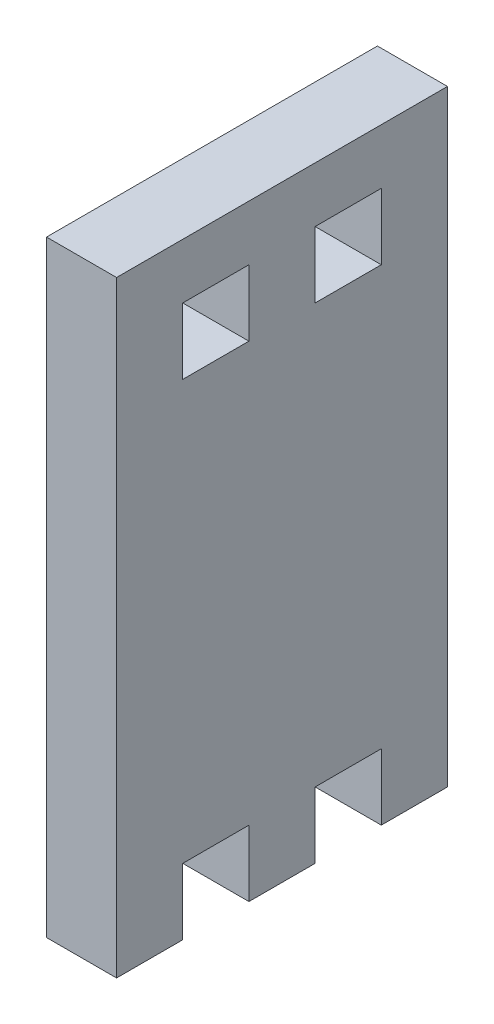
ISO-10303-21;
HEADER;
FILE_DESCRIPTION(('STEP AP214'),'2;1');
FILE_NAME('part.step','',(''),(''),'','','');
FILE_SCHEMA(('AUTOMOTIVE_DESIGN { 1 0 10303 214 1 1 1 1 }'));
ENDSEC;
DATA;
#1=APPLICATION_CONTEXT('core data for automotive mechanical design processes');
#2=APPLICATION_PROTOCOL_DEFINITION('international standard','automotive_design',2000,#1);
#3=PRODUCT_CONTEXT('',#1,'mechanical');
#4=PRODUCT('Part','Part','',(#3));
#5=PRODUCT_RELATED_PRODUCT_CATEGORY('part','',(#4));
#6=PRODUCT_DEFINITION_FORMATION('','',#4);
#7=PRODUCT_DEFINITION_CONTEXT('part definition',#1,'design');
#8=PRODUCT_DEFINITION('design','',#6,#7);
#9=PRODUCT_DEFINITION_SHAPE('','',#8);
#10=(LENGTH_UNIT() NAMED_UNIT(*) SI_UNIT(.MILLI.,.METRE.));
#11=(NAMED_UNIT(*) PLANE_ANGLE_UNIT() SI_UNIT($,.RADIAN.));
#12=(NAMED_UNIT(*) SI_UNIT($,.STERADIAN.) SOLID_ANGLE_UNIT());
#13=UNCERTAINTY_MEASURE_WITH_UNIT(LENGTH_MEASURE(1.E-05),#10,'distance_accuracy_value','');
#14=(GEOMETRIC_REPRESENTATION_CONTEXT(3) GLOBAL_UNCERTAINTY_ASSIGNED_CONTEXT((#13)) GLOBAL_UNIT_ASSIGNED_CONTEXT((#10,
#11,#12)) REPRESENTATION_CONTEXT('',''));
#15=CARTESIAN_POINT('',(0.,0.,0.));
#16=DIRECTION('',(0.,0.,1.));
#17=DIRECTION('',(1.,0.,0.));
#18=AXIS2_PLACEMENT_3D('',#15,#16,#17);
#19=CARTESIAN_POINT('',(6.35,0.,2.99999999999999));
#20=DIRECTION('',(0.,0.,-1.));
#21=DIRECTION('',(0.,1.,0.));
#22=AXIS2_PLACEMENT_3D('',#19,#20,#21);
#23=PLANE('',#22);
#24=DIRECTION('',(0.,-1.,0.));
#25=VECTOR('',#24,1.);
#26=CARTESIAN_POINT('',(0.,0.,2.99999999999999));
#27=LINE('',#26,#25);
#28=CARTESIAN_POINT('',(0.,-21.5,2.99999999999999));
#29=VERTEX_POINT('',#28);
#30=CARTESIAN_POINT('',(0.,-27.5,2.99999999999999));
#31=VERTEX_POINT('',#30);
#32=EDGE_CURVE('E233',#29,#31,#27,.T.);
#33=ORIENTED_EDGE('',*,*,#32,.T.);
#34=DIRECTION('',(-1.,0.,0.));
#35=VECTOR('',#34,1.);
#36=CARTESIAN_POINT('',(6.35,-27.5,2.99999999999999));
#37=LINE('',#36,#35);
#38=CARTESIAN_POINT('',(6.35,-27.5,2.99999999999999));
#39=VERTEX_POINT('',#38);
#40=EDGE_CURVE('E11',#39,#31,#37,.T.);
#41=ORIENTED_EDGE('',*,*,#40,.F.);
#42=DIRECTION('',(0.,-1.,0.));
#43=VECTOR('',#42,1.);
#44=CARTESIAN_POINT('',(6.35,0.,2.99999999999999));
#45=LINE('',#44,#43);
#46=CARTESIAN_POINT('',(6.35,-21.5,2.99999999999999));
#47=VERTEX_POINT('',#46);
#48=EDGE_CURVE('E420',#47,#39,#45,.T.);
#49=ORIENTED_EDGE('',*,*,#48,.F.);
#50=DIRECTION('',(-1.,0.,0.));
#51=VECTOR('',#50,1.);
#52=CARTESIAN_POINT('',(6.35,-21.5,2.99999999999999));
#53=LINE('',#52,#51);
#54=EDGE_CURVE('E52',#47,#29,#53,.T.);
#55=ORIENTED_EDGE('',*,*,#54,.T.);
#56=EDGE_LOOP('',(#33,#41,#49,#55));
#57=FACE_BOUND('',#56,.T.);
#58=ADVANCED_FACE('F33',(#57),#23,.F.);
#59=CARTESIAN_POINT('',(6.35,-27.5,0.));
#60=DIRECTION('',(0.,1.,0.));
#61=DIRECTION('',(0.,0.,1.));
#62=AXIS2_PLACEMENT_3D('',#59,#60,#61);
#63=PLANE('',#62);
#64=DIRECTION('',(0.,0.,-1.));
#65=VECTOR('',#64,1.);
#66=CARTESIAN_POINT('',(0.,-27.5,0.));
#67=LINE('',#66,#65);
#68=CARTESIAN_POINT('',(0.,-27.5,-2.99999999999999));
#69=VERTEX_POINT('',#68);
#70=EDGE_CURVE('E235',#31,#69,#67,.T.);
#71=ORIENTED_EDGE('',*,*,#70,.T.);
#72=DIRECTION('',(-1.,0.,0.));
#73=VECTOR('',#72,1.);
#74=CARTESIAN_POINT('',(6.35,-27.5,-2.99999999999999));
#75=LINE('',#74,#73);
#76=CARTESIAN_POINT('',(6.35,-27.5,-2.99999999999999));
#77=VERTEX_POINT('',#76);
#78=EDGE_CURVE('E43',#77,#69,#75,.T.);
#79=ORIENTED_EDGE('',*,*,#78,.F.);
#80=DIRECTION('',(0.,0.,-1.));
#81=VECTOR('',#80,1.);
#82=CARTESIAN_POINT('',(6.35,-27.5,0.));
#83=LINE('',#82,#81);
#84=EDGE_CURVE('E421',#39,#77,#83,.T.);
#85=ORIENTED_EDGE('',*,*,#84,.F.);
#86=ORIENTED_EDGE('',*,*,#40,.T.);
#87=EDGE_LOOP('',(#71,#79,#85,#86));
#88=FACE_BOUND('',#87,.T.);
#89=ADVANCED_FACE('F323',(#88),#63,.F.);
#90=CARTESIAN_POINT('',(6.35,0.,-2.99999999999999));
#91=DIRECTION('',(0.,0.,-1.));
#92=DIRECTION('',(0.,1.,0.));
#93=AXIS2_PLACEMENT_3D('',#90,#91,#92);
#94=PLANE('',#93);
#95=DIRECTION('',(0.,-1.,0.));
#96=VECTOR('',#95,1.);
#97=CARTESIAN_POINT('',(0.,0.,-2.99999999999999));
#98=LINE('',#97,#96);
#99=CARTESIAN_POINT('',(0.,-21.5,-2.99999999999999));
#100=VERTEX_POINT('',#99);
#101=EDGE_CURVE('E238',#100,#69,#98,.T.);
#102=ORIENTED_EDGE('',*,*,#101,.F.);
#103=DIRECTION('',(-1.,0.,0.));
#104=VECTOR('',#103,1.);
#105=CARTESIAN_POINT('',(6.35,-21.5,-2.99999999999999));
#106=LINE('',#105,#104);
#107=CARTESIAN_POINT('',(6.35,-21.5,-2.99999999999999));
#108=VERTEX_POINT('',#107);
#109=EDGE_CURVE('E279',#108,#100,#106,.T.);
#110=ORIENTED_EDGE('',*,*,#109,.F.);
#111=DIRECTION('',(0.,-1.,0.));
#112=VECTOR('',#111,1.);
#113=CARTESIAN_POINT('',(6.35,0.,-2.99999999999999));
#114=LINE('',#113,#112);
#115=EDGE_CURVE('E406',#108,#77,#114,.T.);
#116=ORIENTED_EDGE('',*,*,#115,.T.);
#117=ORIENTED_EDGE('',*,*,#78,.T.);
#118=EDGE_LOOP('',(#102,#110,#116,#117));
#119=FACE_BOUND('',#118,.T.);
#120=ADVANCED_FACE('F328',(#119),#94,.T.);
#121=CARTESIAN_POINT('',(6.35,-21.5,0.));
#122=DIRECTION('',(0.,1.,0.));
#123=DIRECTION('',(0.,0.,1.));
#124=AXIS2_PLACEMENT_3D('',#121,#122,#123);
#125=PLANE('',#124);
#126=DIRECTION('',(0.,0.,-1.));
#127=VECTOR('',#126,1.);
#128=CARTESIAN_POINT('',(0.,-21.5,0.));
#129=LINE('',#128,#127);
#130=CARTESIAN_POINT('',(0.,-21.5,-8.99999999999999));
#131=VERTEX_POINT('',#130);
#132=EDGE_CURVE('E241',#100,#131,#129,.T.);
#133=ORIENTED_EDGE('',*,*,#132,.T.);
#134=DIRECTION('',(-1.,0.,0.));
#135=VECTOR('',#134,1.);
#136=CARTESIAN_POINT('',(6.35,-21.5,-8.99999999999999));
#137=LINE('',#136,#135);
#138=CARTESIAN_POINT('',(6.35,-21.5,-8.99999999999999));
#139=VERTEX_POINT('',#138);
#140=EDGE_CURVE('E276',#139,#131,#137,.T.);
#141=ORIENTED_EDGE('',*,*,#140,.F.);
#142=DIRECTION('',(0.,0.,-1.));
#143=VECTOR('',#142,1.);
#144=CARTESIAN_POINT('',(6.35,-21.5,0.));
#145=LINE('',#144,#143);
#146=EDGE_CURVE('E402',#108,#139,#145,.T.);
#147=ORIENTED_EDGE('',*,*,#146,.F.);
#148=ORIENTED_EDGE('',*,*,#109,.T.);
#149=EDGE_LOOP('',(#133,#141,#147,#148));
#150=FACE_BOUND('',#149,.T.);
#151=ADVANCED_FACE('F380',(#150),#125,.F.);
#152=CARTESIAN_POINT('',(6.35,0.,-8.99999999999999));
#153=DIRECTION('',(0.,0.,-1.));
#154=DIRECTION('',(0.,1.,0.));
#155=AXIS2_PLACEMENT_3D('',#152,#153,#154);
#156=PLANE('',#155);
#157=DIRECTION('',(0.,-1.,0.));
#158=VECTOR('',#157,1.);
#159=CARTESIAN_POINT('',(0.,0.,-8.99999999999999));
#160=LINE('',#159,#158);
#161=CARTESIAN_POINT('',(0.,-27.5,-8.99999999999999));
#162=VERTEX_POINT('',#161);
#163=EDGE_CURVE('E243',#131,#162,#160,.T.);
#164=ORIENTED_EDGE('',*,*,#163,.T.);
#165=DIRECTION('',(-1.,0.,0.));
#166=VECTOR('',#165,1.);
#167=CARTESIAN_POINT('',(6.35,-27.5,-8.99999999999999));
#168=LINE('',#167,#166);
#169=CARTESIAN_POINT('',(6.35,-27.5,-8.99999999999999));
#170=VERTEX_POINT('',#169);
#171=EDGE_CURVE('E273',#170,#162,#168,.T.);
#172=ORIENTED_EDGE('',*,*,#171,.F.);
#173=DIRECTION('',(0.,-1.,0.));
#174=VECTOR('',#173,1.);
#175=CARTESIAN_POINT('',(6.35,0.,-8.99999999999999));
#176=LINE('',#175,#174);
#177=EDGE_CURVE('E399',#139,#170,#176,.T.);
#178=ORIENTED_EDGE('',*,*,#177,.F.);
#179=ORIENTED_EDGE('',*,*,#140,.T.);
#180=EDGE_LOOP('',(#164,#172,#178,#179));
#181=FACE_BOUND('',#180,.T.);
#182=ADVANCED_FACE('F376',(#181),#156,.F.);
#183=CARTESIAN_POINT('',(6.35,-27.5,0.));
#184=DIRECTION('',(0.,1.,0.));
#185=DIRECTION('',(0.,0.,1.));
#186=AXIS2_PLACEMENT_3D('',#183,#184,#185);
#187=PLANE('',#186);
#188=DIRECTION('',(0.,0.,-1.));
#189=VECTOR('',#188,1.);
#190=CARTESIAN_POINT('',(0.,-27.5,0.));
#191=LINE('',#190,#189);
#192=CARTESIAN_POINT('',(0.,-27.5,-15.));
#193=VERTEX_POINT('',#192);
#194=EDGE_CURVE('E245',#162,#193,#191,.T.);
#195=ORIENTED_EDGE('',*,*,#194,.T.);
#196=DIRECTION('',(-1.,0.,0.));
#197=VECTOR('',#196,1.);
#198=CARTESIAN_POINT('',(6.35,-27.5,-15.));
#199=LINE('',#198,#197);
#200=CARTESIAN_POINT('',(6.35,-27.5,-15.));
#201=VERTEX_POINT('',#200);
#202=EDGE_CURVE('E271',#201,#193,#199,.T.);
#203=ORIENTED_EDGE('',*,*,#202,.F.);
#204=DIRECTION('',(0.,0.,-1.));
#205=VECTOR('',#204,1.);
#206=CARTESIAN_POINT('',(6.35,-27.5,0.));
#207=LINE('',#206,#205);
#208=EDGE_CURVE('E401',#170,#201,#207,.T.);
#209=ORIENTED_EDGE('',*,*,#208,.F.);
#210=ORIENTED_EDGE('',*,*,#171,.T.);
#211=EDGE_LOOP('',(#195,#203,#209,#210));
#212=FACE_BOUND('',#211,.T.);
#213=ADVANCED_FACE('F372',(#212),#187,.F.);
#214=CARTESIAN_POINT('',(6.35,0.,-15.));
#215=DIRECTION('',(0.,0.,-1.));
#216=DIRECTION('',(0.,1.,0.));
#217=AXIS2_PLACEMENT_3D('',#214,#215,#216);
#218=PLANE('',#217);
#219=DIRECTION('',(0.,-1.,0.));
#220=VECTOR('',#219,1.);
#221=CARTESIAN_POINT('',(0.,0.,-15.));
#222=LINE('',#221,#220);
#223=CARTESIAN_POINT('',(0.,27.5,-15.));
#224=VERTEX_POINT('',#223);
#225=EDGE_CURVE('E248',#224,#193,#222,.T.);
#226=ORIENTED_EDGE('',*,*,#225,.F.);
#227=DIRECTION('',(-1.,0.,0.));
#228=VECTOR('',#227,1.);
#229=CARTESIAN_POINT('',(6.35,27.5,-15.));
#230=LINE('',#229,#228);
#231=CARTESIAN_POINT('',(6.35,27.5,-15.));
#232=VERTEX_POINT('',#231);
#233=EDGE_CURVE('E269',#232,#224,#230,.T.);
#234=ORIENTED_EDGE('',*,*,#233,.F.);
#235=DIRECTION('',(0.,-1.,0.));
#236=VECTOR('',#235,1.);
#237=CARTESIAN_POINT('',(6.35,0.,-15.));
#238=LINE('',#237,#236);
#239=EDGE_CURVE('E404',#232,#201,#238,.T.);
#240=ORIENTED_EDGE('',*,*,#239,.T.);
#241=ORIENTED_EDGE('',*,*,#202,.T.);
#242=EDGE_LOOP('',(#226,#234,#240,#241));
#243=FACE_BOUND('',#242,.T.);
#244=ADVANCED_FACE('F368',(#243),#218,.T.);
#245=CARTESIAN_POINT('',(6.35,27.5,0.));
#246=DIRECTION('',(0.,1.,0.));
#247=DIRECTION('',(0.,0.,1.));
#248=AXIS2_PLACEMENT_3D('',#245,#246,#247);
#249=PLANE('',#248);
#250=DIRECTION('',(0.,0.,-1.));
#251=VECTOR('',#250,1.);
#252=CARTESIAN_POINT('',(0.,27.5,0.));
#253=LINE('',#252,#251);
#254=CARTESIAN_POINT('',(0.,27.5,15.));
#255=VERTEX_POINT('',#254);
#256=EDGE_CURVE('E251',#255,#224,#253,.T.);
#257=ORIENTED_EDGE('',*,*,#256,.F.);
#258=DIRECTION('',(-1.,0.,0.));
#259=VECTOR('',#258,1.);
#260=CARTESIAN_POINT('',(6.35,27.5,15.));
#261=LINE('',#260,#259);
#262=CARTESIAN_POINT('',(6.35,27.5,15.));
#263=VERTEX_POINT('',#262);
#264=EDGE_CURVE('E267',#263,#255,#261,.T.);
#265=ORIENTED_EDGE('',*,*,#264,.F.);
#266=DIRECTION('',(0.,0.,-1.));
#267=VECTOR('',#266,1.);
#268=CARTESIAN_POINT('',(6.35,27.5,0.));
#269=LINE('',#268,#267);
#270=EDGE_CURVE('E412',#263,#232,#269,.T.);
#271=ORIENTED_EDGE('',*,*,#270,.T.);
#272=ORIENTED_EDGE('',*,*,#233,.T.);
#273=EDGE_LOOP('',(#257,#265,#271,#272));
#274=FACE_BOUND('',#273,.T.);
#275=ADVANCED_FACE('F364',(#274),#249,.T.);
#276=CARTESIAN_POINT('',(6.35,0.,15.));
#277=DIRECTION('',(0.,0.,-1.));
#278=DIRECTION('',(0.,1.,0.));
#279=AXIS2_PLACEMENT_3D('',#276,#277,#278);
#280=PLANE('',#279);
#281=DIRECTION('',(0.,-1.,0.));
#282=VECTOR('',#281,1.);
#283=CARTESIAN_POINT('',(0.,0.,15.));
#284=LINE('',#283,#282);
#285=CARTESIAN_POINT('',(0.,-27.5,15.));
#286=VERTEX_POINT('',#285);
#287=EDGE_CURVE('E254',#255,#286,#284,.T.);
#288=ORIENTED_EDGE('',*,*,#287,.T.);
#289=DIRECTION('',(-1.,0.,0.));
#290=VECTOR('',#289,1.);
#291=CARTESIAN_POINT('',(6.35,-27.5,15.));
#292=LINE('',#291,#290);
#293=CARTESIAN_POINT('',(6.35,-27.5,15.));
#294=VERTEX_POINT('',#293);
#295=EDGE_CURVE('E200',#294,#286,#292,.T.);
#296=ORIENTED_EDGE('',*,*,#295,.F.);
#297=DIRECTION('',(0.,-1.,0.));
#298=VECTOR('',#297,1.);
#299=CARTESIAN_POINT('',(6.35,0.,15.));
#300=LINE('',#299,#298);
#301=EDGE_CURVE('E188',#263,#294,#300,.T.);
#302=ORIENTED_EDGE('',*,*,#301,.F.);
#303=ORIENTED_EDGE('',*,*,#264,.T.);
#304=EDGE_LOOP('',(#288,#296,#302,#303));
#305=FACE_BOUND('',#304,.T.);
#306=ADVANCED_FACE('F361',(#305),#280,.F.);
#307=CARTESIAN_POINT('',(6.35,-27.5,0.));
#308=DIRECTION('',(0.,1.,0.));
#309=DIRECTION('',(0.,0.,1.));
#310=AXIS2_PLACEMENT_3D('',#307,#308,#309);
#311=PLANE('',#310);
#312=DIRECTION('',(0.,0.,-1.));
#313=VECTOR('',#312,1.);
#314=CARTESIAN_POINT('',(0.,-27.5,0.));
#315=LINE('',#314,#313);
#316=CARTESIAN_POINT('',(0.,-27.5,8.99999999999999));
#317=VERTEX_POINT('',#316);
#318=EDGE_CURVE('E197',#286,#317,#315,.T.);
#319=ORIENTED_EDGE('',*,*,#318,.T.);
#320=DIRECTION('',(-1.,0.,0.));
#321=VECTOR('',#320,1.);
#322=CARTESIAN_POINT('',(6.35,-27.5,8.99999999999999));
#323=LINE('',#322,#321);
#324=CARTESIAN_POINT('',(6.35,-27.5,8.99999999999999));
#325=VERTEX_POINT('',#324);
#326=EDGE_CURVE('E194',#325,#317,#323,.T.);
#327=ORIENTED_EDGE('',*,*,#326,.F.);
#328=DIRECTION('',(0.,0.,-1.));
#329=VECTOR('',#328,1.);
#330=CARTESIAN_POINT('',(6.35,-27.5,0.));
#331=LINE('',#330,#329);
#332=EDGE_CURVE('E179',#294,#325,#331,.T.);
#333=ORIENTED_EDGE('',*,*,#332,.F.);
#334=ORIENTED_EDGE('',*,*,#295,.T.);
#335=EDGE_LOOP('',(#319,#327,#333,#334));
#336=FACE_BOUND('',#335,.T.);
#337=ADVANCED_FACE('F195',(#336),#311,.F.);
#338=CARTESIAN_POINT('',(6.35,0.,8.99999999999999));
#339=DIRECTION('',(0.,0.,-1.));
#340=DIRECTION('',(0.,1.,0.));
#341=AXIS2_PLACEMENT_3D('',#338,#339,#340);
#342=PLANE('',#341);
#343=DIRECTION('',(0.,-1.,0.));
#344=VECTOR('',#343,1.);
#345=CARTESIAN_POINT('',(0.,0.,8.99999999999999));
#346=LINE('',#345,#344);
#347=CARTESIAN_POINT('',(0.,-21.5,8.99999999999999));
#348=VERTEX_POINT('',#347);
#349=EDGE_CURVE('E257',#348,#317,#346,.T.);
#350=ORIENTED_EDGE('',*,*,#349,.F.);
#351=DIRECTION('',(-1.,0.,0.));
#352=VECTOR('',#351,1.);
#353=CARTESIAN_POINT('',(6.35,-21.5,8.99999999999999));
#354=LINE('',#353,#352);
#355=CARTESIAN_POINT('',(6.35,-21.5,8.99999999999999));
#356=VERTEX_POINT('',#355);
#357=EDGE_CURVE('E114',#356,#348,#354,.T.);
#358=ORIENTED_EDGE('',*,*,#357,.F.);
#359=DIRECTION('',(0.,-1.,0.));
#360=VECTOR('',#359,1.);
#361=CARTESIAN_POINT('',(6.35,0.,8.99999999999999));
#362=LINE('',#361,#360);
#363=EDGE_CURVE('E185',#356,#325,#362,.T.);
#364=ORIENTED_EDGE('',*,*,#363,.T.);
#365=ORIENTED_EDGE('',*,*,#326,.T.);
#366=EDGE_LOOP('',(#350,#358,#364,#365));
#367=FACE_BOUND('',#366,.T.);
#368=ADVANCED_FACE('F202',(#367),#342,.T.);
#369=CARTESIAN_POINT('',(6.35,22.5,0.));
#370=DIRECTION('',(0.,1.,0.));
#371=DIRECTION('',(0.,0.,1.));
#372=AXIS2_PLACEMENT_3D('',#369,#370,#371);
#373=PLANE('',#372);
#374=DIRECTION('',(0.,0.,-1.));
#375=VECTOR('',#374,1.);
#376=CARTESIAN_POINT('',(0.,22.5,0.));
#377=LINE('',#376,#375);
#378=CARTESIAN_POINT('',(0.,22.5,9.));
#379=VERTEX_POINT('',#378);
#380=CARTESIAN_POINT('',(0.,22.5,3.));
#381=VERTEX_POINT('',#380);
#382=EDGE_CURVE('E221',#379,#381,#377,.T.);
#383=ORIENTED_EDGE('',*,*,#382,.T.);
#384=DIRECTION('',(-1.,0.,0.));
#385=VECTOR('',#384,1.);
#386=CARTESIAN_POINT('',(6.35,22.5,3.));
#387=LINE('',#386,#385);
#388=CARTESIAN_POINT('',(6.35,22.5,3.));
#389=VERTEX_POINT('',#388);
#390=EDGE_CURVE('E264',#389,#381,#387,.T.);
#391=ORIENTED_EDGE('',*,*,#390,.F.);
#392=DIRECTION('',(0.,0.,-1.));
#393=VECTOR('',#392,1.);
#394=CARTESIAN_POINT('',(6.35,22.5,0.));
#395=LINE('',#394,#393);
#396=CARTESIAN_POINT('',(6.35,22.5,9.));
#397=VERTEX_POINT('',#396);
#398=EDGE_CURVE('E434',#397,#389,#395,.T.);
#399=ORIENTED_EDGE('',*,*,#398,.F.);
#400=DIRECTION('',(-1.,0.,0.));
#401=VECTOR('',#400,1.);
#402=CARTESIAN_POINT('',(6.35,22.5,9.));
#403=LINE('',#402,#401);
#404=EDGE_CURVE('E282',#397,#379,#403,.T.);
#405=ORIENTED_EDGE('',*,*,#404,.T.);
#406=EDGE_LOOP('',(#383,#391,#399,#405));
#407=FACE_BOUND('',#406,.T.);
#408=ADVANCED_FACE('F340',(#407),#373,.F.);
#409=CARTESIAN_POINT('',(6.35,0.,3.));
#410=DIRECTION('',(0.,0.,-1.));
#411=DIRECTION('',(-1.,0.,0.));
#412=AXIS2_PLACEMENT_3D('',#409,#410,#411);
#413=PLANE('',#412);
#414=DIRECTION('',(0.,-1.,0.));
#415=VECTOR('',#414,1.);
#416=CARTESIAN_POINT('',(0.,0.,3.));
#417=LINE('',#416,#415);
#418=CARTESIAN_POINT('',(0.,16.5,3.));
#419=VERTEX_POINT('',#418);
#420=EDGE_CURVE('E224',#381,#419,#417,.T.);
#421=ORIENTED_EDGE('',*,*,#420,.T.);
#422=DIRECTION('',(-1.,0.,0.));
#423=VECTOR('',#422,1.);
#424=CARTESIAN_POINT('',(6.35,16.5,3.));
#425=LINE('',#424,#423);
#426=CARTESIAN_POINT('',(6.35,16.5,3.));
#427=VERTEX_POINT('',#426);
#428=EDGE_CURVE('E286',#427,#419,#425,.T.);
#429=ORIENTED_EDGE('',*,*,#428,.F.);
#430=DIRECTION('',(0.,-1.,0.));
#431=VECTOR('',#430,1.);
#432=CARTESIAN_POINT('',(6.35,0.,3.));
#433=LINE('',#432,#431);
#434=EDGE_CURVE('E432',#389,#427,#433,.T.);
#435=ORIENTED_EDGE('',*,*,#434,.F.);
#436=ORIENTED_EDGE('',*,*,#390,.T.);
#437=EDGE_LOOP('',(#421,#429,#435,#436));
#438=FACE_BOUND('',#437,.T.);
#439=ADVANCED_FACE('F336',(#438),#413,.F.);
#440=CARTESIAN_POINT('',(6.35,16.5,0.));
#441=DIRECTION('',(0.,1.,0.));
#442=DIRECTION('',(0.,0.,1.));
#443=AXIS2_PLACEMENT_3D('',#440,#441,#442);
#444=PLANE('',#443);
#445=DIRECTION('',(0.,0.,-1.));
#446=VECTOR('',#445,1.);
#447=CARTESIAN_POINT('',(0.,16.5,0.));
#448=LINE('',#447,#446);
#449=CARTESIAN_POINT('',(0.,16.5,8.99999999999999));
#450=VERTEX_POINT('',#449);
#451=EDGE_CURVE('E227',#450,#419,#448,.T.);
#452=ORIENTED_EDGE('',*,*,#451,.F.);
#453=DIRECTION('',(-1.,0.,0.));
#454=VECTOR('',#453,1.);
#455=CARTESIAN_POINT('',(6.35,16.5,8.99999999999999));
#456=LINE('',#455,#454);
#457=CARTESIAN_POINT('',(6.35,16.5,8.99999999999999));
#458=VERTEX_POINT('',#457);
#459=EDGE_CURVE('E284',#458,#450,#456,.T.);
#460=ORIENTED_EDGE('',*,*,#459,.F.);
#461=DIRECTION('',(0.,0.,-1.));
#462=VECTOR('',#461,1.);
#463=CARTESIAN_POINT('',(6.35,16.5,0.));
#464=LINE('',#463,#462);
#465=EDGE_CURVE('E427',#458,#427,#464,.T.);
#466=ORIENTED_EDGE('',*,*,#465,.T.);
#467=ORIENTED_EDGE('',*,*,#428,.T.);
#468=EDGE_LOOP('',(#452,#460,#466,#467));
#469=FACE_BOUND('',#468,.T.);
#470=ADVANCED_FACE('F333',(#469),#444,.T.);
#471=CARTESIAN_POINT('',(6.35,0.,-8.99999999999998));
#472=DIRECTION('',(0.,0.,-1.));
#473=DIRECTION('',(-1.,0.,0.));
#474=AXIS2_PLACEMENT_3D('',#471,#472,#473);
#475=PLANE('',#474);
#476=DIRECTION('',(0.,-1.,0.));
#477=VECTOR('',#476,1.);
#478=CARTESIAN_POINT('',(0.,0.,-8.99999999999998));
#479=LINE('',#478,#477);
#480=CARTESIAN_POINT('',(0.,22.5,-8.99999999999998));
#481=VERTEX_POINT('',#480);
#482=CARTESIAN_POINT('',(0.,16.5,-8.99999999999998));
#483=VERTEX_POINT('',#482);
#484=EDGE_CURVE('E209',#481,#483,#479,.T.);
#485=ORIENTED_EDGE('',*,*,#484,.T.);
#486=DIRECTION('',(-1.,0.,0.));
#487=VECTOR('',#486,1.);
#488=CARTESIAN_POINT('',(6.35,16.5,-8.99999999999998));
#489=LINE('',#488,#487);
#490=CARTESIAN_POINT('',(6.35,16.5,-8.99999999999998));
#491=VERTEX_POINT('',#490);
#492=EDGE_CURVE('E37',#491,#483,#489,.T.);
#493=ORIENTED_EDGE('',*,*,#492,.F.);
#494=DIRECTION('',(0.,-1.,0.));
#495=VECTOR('',#494,1.);
#496=CARTESIAN_POINT('',(6.35,0.,-8.99999999999998));
#497=LINE('',#496,#495);
#498=CARTESIAN_POINT('',(6.35,22.5,-8.99999999999998));
#499=VERTEX_POINT('',#498);
#500=EDGE_CURVE('E262',#499,#491,#497,.T.);
#501=ORIENTED_EDGE('',*,*,#500,.F.);
#502=DIRECTION('',(-1.,0.,0.));
#503=VECTOR('',#502,1.);
#504=CARTESIAN_POINT('',(6.35,22.5,-8.99999999999998));
#505=LINE('',#504,#503);
#506=EDGE_CURVE('E205',#499,#481,#505,.T.);
#507=ORIENTED_EDGE('',*,*,#506,.T.);
#508=EDGE_LOOP('',(#485,#493,#501,#507));
#509=FACE_BOUND('',#508,.T.);
#510=ADVANCED_FACE('F35',(#509),#475,.F.);
#511=CARTESIAN_POINT('',(6.35,16.5,0.));
#512=DIRECTION('',(0.,-1.,0.));
#513=DIRECTION('',(0.,0.,-1.));
#514=AXIS2_PLACEMENT_3D('',#511,#512,#513);
#515=PLANE('',#514);
#516=DIRECTION('',(0.,0.,1.));
#517=VECTOR('',#516,1.);
#518=CARTESIAN_POINT('',(0.,16.5,0.));
#519=LINE('',#518,#517);
#520=CARTESIAN_POINT('',(0.,16.5,-3.00000000000001));
#521=VERTEX_POINT('',#520);
#522=EDGE_CURVE('E212',#483,#521,#519,.T.);
#523=ORIENTED_EDGE('',*,*,#522,.T.);
#524=DIRECTION('',(-1.,0.,0.));
#525=VECTOR('',#524,1.);
#526=CARTESIAN_POINT('',(6.35,16.5,-3.00000000000001));
#527=LINE('',#526,#525);
#528=CARTESIAN_POINT('',(6.35,16.5,-3.00000000000001));
#529=VERTEX_POINT('',#528);
#530=EDGE_CURVE('E292',#529,#521,#527,.T.);
#531=ORIENTED_EDGE('',*,*,#530,.F.);
#532=DIRECTION('',(0.,0.,1.));
#533=VECTOR('',#532,1.);
#534=CARTESIAN_POINT('',(6.35,16.5,0.));
#535=LINE('',#534,#533);
#536=EDGE_CURVE('E127',#491,#529,#535,.T.);
#537=ORIENTED_EDGE('',*,*,#536,.F.);
#538=ORIENTED_EDGE('',*,*,#492,.T.);
#539=EDGE_LOOP('',(#523,#531,#537,#538));
#540=FACE_BOUND('',#539,.T.);
#541=ADVANCED_FACE('F297',(#540),#515,.F.);
#542=CARTESIAN_POINT('',(6.35,0.,-3.00000000000001));
#543=DIRECTION('',(0.,0.,-1.));
#544=DIRECTION('',(0.,1.,0.));
#545=AXIS2_PLACEMENT_3D('',#542,#543,#544);
#546=PLANE('',#545);
#547=DIRECTION('',(0.,-1.,0.));
#548=VECTOR('',#547,1.);
#549=CARTESIAN_POINT('',(0.,0.,-3.00000000000001));
#550=LINE('',#549,#548);
#551=CARTESIAN_POINT('',(0.,22.5,-3.00000000000001));
#552=VERTEX_POINT('',#551);
#553=EDGE_CURVE('E215',#552,#521,#550,.T.);
#554=ORIENTED_EDGE('',*,*,#553,.F.);
#555=DIRECTION('',(-1.,0.,0.));
#556=VECTOR('',#555,1.);
#557=CARTESIAN_POINT('',(6.35,22.5,-3.00000000000001));
#558=LINE('',#557,#556);
#559=CARTESIAN_POINT('',(6.35,22.5,-3.00000000000001));
#560=VERTEX_POINT('',#559);
#561=EDGE_CURVE('E291',#560,#552,#558,.T.);
#562=ORIENTED_EDGE('',*,*,#561,.F.);
#563=DIRECTION('',(0.,-1.,0.));
#564=VECTOR('',#563,1.);
#565=CARTESIAN_POINT('',(6.35,0.,-3.00000000000001));
#566=LINE('',#565,#564);
#567=EDGE_CURVE('E438',#560,#529,#566,.T.);
#568=ORIENTED_EDGE('',*,*,#567,.T.);
#569=ORIENTED_EDGE('',*,*,#530,.T.);
#570=EDGE_LOOP('',(#554,#562,#568,#569));
#571=FACE_BOUND('',#570,.T.);
#572=ADVANCED_FACE('F311',(#571),#546,.T.);
#573=CARTESIAN_POINT('',(6.35,0.,8.99999999999998));
#574=DIRECTION('',(0.,0.,-1.));
#575=DIRECTION('',(0.,1.,0.));
#576=AXIS2_PLACEMENT_3D('',#573,#574,#575);
#577=PLANE('',#576);
#578=DIRECTION('',(0.,-1.,0.));
#579=VECTOR('',#578,1.);
#580=CARTESIAN_POINT('',(0.,0.,8.99999999999998));
#581=LINE('',#580,#579);
#582=EDGE_CURVE('E230',#379,#450,#581,.T.);
#583=ORIENTED_EDGE('',*,*,#582,.F.);
#584=ORIENTED_EDGE('',*,*,#404,.F.);
#585=DIRECTION('',(0.,-1.,0.));
#586=VECTOR('',#585,1.);
#587=CARTESIAN_POINT('',(6.35,0.,8.99999999999998));
#588=LINE('',#587,#586);
#589=EDGE_CURVE('E424',#397,#458,#588,.T.);
#590=ORIENTED_EDGE('',*,*,#589,.T.);
#591=ORIENTED_EDGE('',*,*,#459,.T.);
#592=EDGE_LOOP('',(#583,#584,#590,#591));
#593=FACE_BOUND('',#592,.T.);
#594=ADVANCED_FACE('F313',(#593),#577,.T.);
#595=CARTESIAN_POINT('',(6.35,22.5,0.));
#596=DIRECTION('',(0.,-1.,0.));
#597=DIRECTION('',(0.,0.,-1.));
#598=AXIS2_PLACEMENT_3D('',#595,#596,#597);
#599=PLANE('',#598);
#600=DIRECTION('',(0.,0.,1.));
#601=VECTOR('',#600,1.);
#602=CARTESIAN_POINT('',(0.,22.5,0.));
#603=LINE('',#602,#601);
#604=EDGE_CURVE('E218',#481,#552,#603,.T.);
#605=ORIENTED_EDGE('',*,*,#604,.F.);
#606=ORIENTED_EDGE('',*,*,#506,.F.);
#607=DIRECTION('',(0.,0.,1.));
#608=VECTOR('',#607,1.);
#609=CARTESIAN_POINT('',(6.35,22.5,0.));
#610=LINE('',#609,#608);
#611=EDGE_CURVE('E309',#499,#560,#610,.T.);
#612=ORIENTED_EDGE('',*,*,#611,.T.);
#613=ORIENTED_EDGE('',*,*,#561,.T.);
#614=EDGE_LOOP('',(#605,#606,#612,#613));
#615=FACE_BOUND('',#614,.T.);
#616=ADVANCED_FACE('F306',(#615),#599,.T.);
#617=CARTESIAN_POINT('',(6.35,-21.5,0.));
#618=DIRECTION('',(0.,-1.,0.));
#619=DIRECTION('',(0.,0.,-1.));
#620=AXIS2_PLACEMENT_3D('',#617,#618,#619);
#621=PLANE('',#620);
#622=DIRECTION('',(0.,0.,1.));
#623=VECTOR('',#622,1.);
#624=CARTESIAN_POINT('',(0.,-21.5,0.));
#625=LINE('',#624,#623);
#626=EDGE_CURVE('E259',#29,#348,#625,.T.);
#627=ORIENTED_EDGE('',*,*,#626,.F.);
#628=ORIENTED_EDGE('',*,*,#54,.F.);
#629=DIRECTION('',(0.,0.,1.));
#630=VECTOR('',#629,1.);
#631=CARTESIAN_POINT('',(6.35,-21.5,0.));
#632=LINE('',#631,#630);
#633=EDGE_CURVE('E203',#47,#356,#632,.T.);
#634=ORIENTED_EDGE('',*,*,#633,.T.);
#635=ORIENTED_EDGE('',*,*,#357,.T.);
#636=EDGE_LOOP('',(#627,#628,#634,#635));
#637=FACE_BOUND('',#636,.T.);
#638=ADVANCED_FACE('F345',(#637),#621,.T.);
#639=CARTESIAN_POINT('',(6.35,0.,0.));
#640=DIRECTION('',(1.,0.,0.));
#641=DIRECTION('',(0.,0.,-1.));
#642=AXIS2_PLACEMENT_3D('',#639,#640,#641);
#643=PLANE('',#642);
#644=ORIENTED_EDGE('',*,*,#500,.T.);
#645=ORIENTED_EDGE('',*,*,#536,.T.);
#646=ORIENTED_EDGE('',*,*,#567,.F.);
#647=ORIENTED_EDGE('',*,*,#611,.F.);
#648=EDGE_LOOP('',(#644,#645,#646,#647));
#649=FACE_BOUND('',#648,.T.);
#650=ORIENTED_EDGE('',*,*,#398,.T.);
#651=ORIENTED_EDGE('',*,*,#434,.T.);
#652=ORIENTED_EDGE('',*,*,#465,.F.);
#653=ORIENTED_EDGE('',*,*,#589,.F.);
#654=EDGE_LOOP('',(#650,#651,#652,#653));
#655=FACE_BOUND('',#654,.T.);
#656=ORIENTED_EDGE('',*,*,#48,.T.);
#657=ORIENTED_EDGE('',*,*,#84,.T.);
#658=ORIENTED_EDGE('',*,*,#115,.F.);
#659=ORIENTED_EDGE('',*,*,#146,.T.);
#660=ORIENTED_EDGE('',*,*,#177,.T.);
#661=ORIENTED_EDGE('',*,*,#208,.T.);
#662=ORIENTED_EDGE('',*,*,#239,.F.);
#663=ORIENTED_EDGE('',*,*,#270,.F.);
#664=ORIENTED_EDGE('',*,*,#301,.T.);
#665=ORIENTED_EDGE('',*,*,#332,.T.);
#666=ORIENTED_EDGE('',*,*,#363,.F.);
#667=ORIENTED_EDGE('',*,*,#633,.F.);
#668=EDGE_LOOP('',(#656,#657,#658,#659,#660,#661,#662,#663,#664,#665,#666,#667));
#669=FACE_BOUND('',#668,.T.);
#670=ADVANCED_FACE('F182',(#649,#655,#669),#643,.T.);
#671=CARTESIAN_POINT('',(0.,0.,0.));
#672=DIRECTION('',(1.,0.,0.));
#673=DIRECTION('',(0.,0.,-1.));
#674=AXIS2_PLACEMENT_3D('',#671,#672,#673);
#675=PLANE('',#674);
#676=ORIENTED_EDGE('',*,*,#484,.F.);
#677=ORIENTED_EDGE('',*,*,#604,.T.);
#678=ORIENTED_EDGE('',*,*,#553,.T.);
#679=ORIENTED_EDGE('',*,*,#522,.F.);
#680=EDGE_LOOP('',(#676,#677,#678,#679));
#681=FACE_BOUND('',#680,.T.);
#682=ORIENTED_EDGE('',*,*,#382,.F.);
#683=ORIENTED_EDGE('',*,*,#582,.T.);
#684=ORIENTED_EDGE('',*,*,#451,.T.);
#685=ORIENTED_EDGE('',*,*,#420,.F.);
#686=EDGE_LOOP('',(#682,#683,#684,#685));
#687=FACE_BOUND('',#686,.T.);
#688=ORIENTED_EDGE('',*,*,#32,.F.);
#689=ORIENTED_EDGE('',*,*,#626,.T.);
#690=ORIENTED_EDGE('',*,*,#349,.T.);
#691=ORIENTED_EDGE('',*,*,#318,.F.);
#692=ORIENTED_EDGE('',*,*,#287,.F.);
#693=ORIENTED_EDGE('',*,*,#256,.T.);
#694=ORIENTED_EDGE('',*,*,#225,.T.);
#695=ORIENTED_EDGE('',*,*,#194,.F.);
#696=ORIENTED_EDGE('',*,*,#163,.F.);
#697=ORIENTED_EDGE('',*,*,#132,.F.);
#698=ORIENTED_EDGE('',*,*,#101,.T.);
#699=ORIENTED_EDGE('',*,*,#70,.F.);
#700=EDGE_LOOP('',(#688,#689,#690,#691,#692,#693,#694,#695,#696,#697,#698,#699));
#701=FACE_BOUND('',#700,.T.);
#702=ADVANCED_FACE('F303',(#681,#687,#701),#675,.F.);
#703=CLOSED_SHELL('',(#58,#89,#120,#151,#182,#213,#244,#275,#306,#337,#368,#408,#439,#470,#510,
#541,#572,#594,#616,#638,#670,#702));
#704=MANIFOLD_SOLID_BREP('B2',#703);
#705=ADVANCED_BREP_SHAPE_REPRESENTATION('',(#18,#704),#14);
#706=SHAPE_DEFINITION_REPRESENTATION(#9,#705);
ENDSEC;
END-ISO-10303-21;
